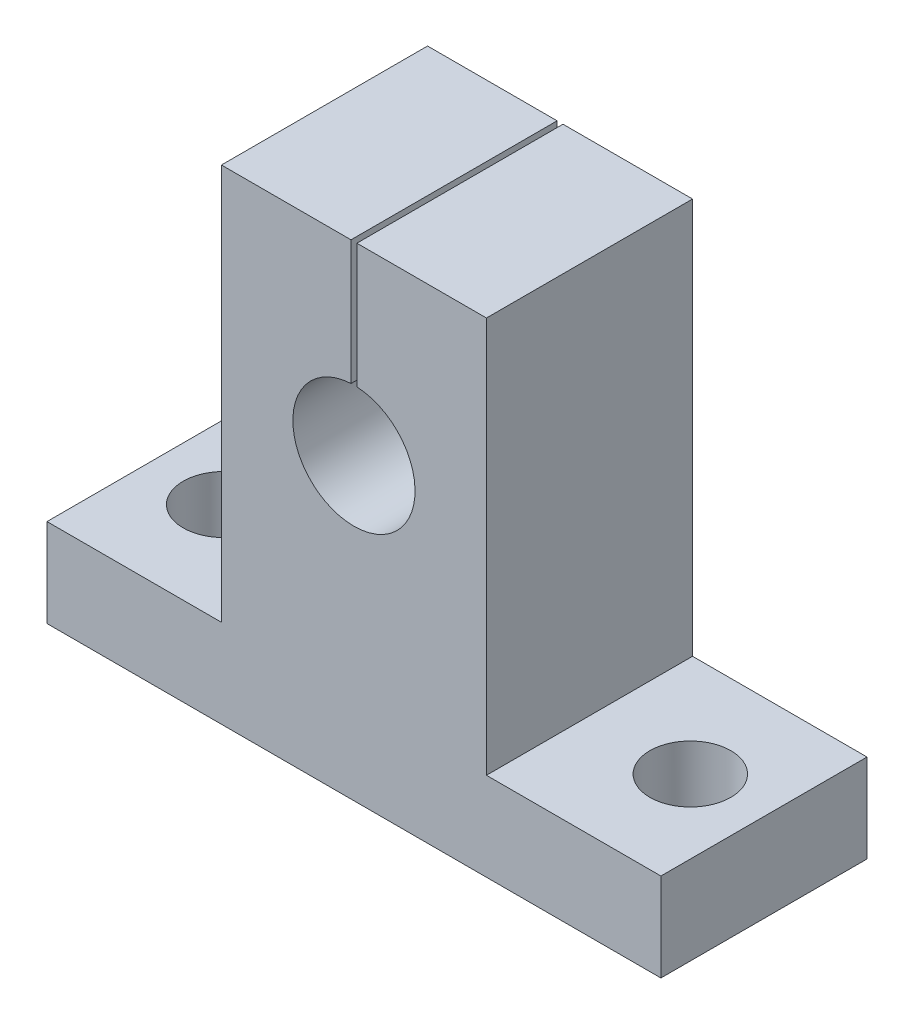
ISO-10303-21;
HEADER;
FILE_DESCRIPTION(('STEP AP214'),'2;1');
FILE_NAME('part.step','',(''),(''),'','','');
FILE_SCHEMA(('AUTOMOTIVE_DESIGN { 1 0 10303 214 1 1 1 1 }'));
ENDSEC;
DATA;
#1=APPLICATION_CONTEXT('core data for automotive mechanical design processes');
#2=APPLICATION_PROTOCOL_DEFINITION('international standard','automotive_design',2000,#1);
#3=PRODUCT_CONTEXT('',#1,'mechanical');
#4=PRODUCT('Part','Part','',(#3));
#5=PRODUCT_RELATED_PRODUCT_CATEGORY('part','',(#4));
#6=PRODUCT_DEFINITION_FORMATION('','',#4);
#7=PRODUCT_DEFINITION_CONTEXT('part definition',#1,'design');
#8=PRODUCT_DEFINITION('design','',#6,#7);
#9=PRODUCT_DEFINITION_SHAPE('','',#8);
#10=(LENGTH_UNIT() NAMED_UNIT(*) SI_UNIT(.MILLI.,.METRE.));
#11=(NAMED_UNIT(*) PLANE_ANGLE_UNIT() SI_UNIT($,.RADIAN.));
#12=(NAMED_UNIT(*) SI_UNIT($,.STERADIAN.) SOLID_ANGLE_UNIT());
#13=UNCERTAINTY_MEASURE_WITH_UNIT(LENGTH_MEASURE(1.E-05),#10,'distance_accuracy_value','');
#14=(GEOMETRIC_REPRESENTATION_CONTEXT(3) GLOBAL_UNCERTAINTY_ASSIGNED_CONTEXT((#13)) GLOBAL_UNIT_ASSIGNED_CONTEXT((#10,
#11,#12)) REPRESENTATION_CONTEXT('',''));
#15=CARTESIAN_POINT('',(0.,0.,0.));
#16=DIRECTION('',(0.,0.,1.));
#17=DIRECTION('',(1.,0.,0.));
#18=AXIS2_PLACEMENT_3D('',#15,#16,#17);
#19=CARTESIAN_POINT('',(0.,20.3,14.));
#20=DIRECTION('',(0.,0.,-1.));
#21=DIRECTION('',(-1.,0.,0.));
#22=AXIS2_PLACEMENT_3D('',#19,#20,#21);
#23=CYLINDRICAL_SURFACE('',#22,4.15);
#24=CARTESIAN_POINT('',(0.,20.3,0.));
#25=DIRECTION('',(0.,0.,1.));
#26=DIRECTION('',(1.,0.,0.));
#27=AXIS2_PLACEMENT_3D('',#24,#25,#26);
#28=CIRCLE('',#27,4.15);
#29=CARTESIAN_POINT('',(-0.200000000000001,24.4451779213925,0.));
#30=VERTEX_POINT('',#29);
#31=CARTESIAN_POINT('',(0.199999999999999,24.4451779213925,0.));
#32=VERTEX_POINT('',#31);
#33=EDGE_CURVE('E153',#30,#32,#28,.T.);
#34=ORIENTED_EDGE('',*,*,#33,.F.);
#35=DIRECTION('',(0.,0.,-1.));
#36=VECTOR('',#35,1.);
#37=CARTESIAN_POINT('',(-0.200000000000001,24.4451779213925,14.));
#38=LINE('',#37,#36);
#39=CARTESIAN_POINT('',(-0.200000000000001,24.4451779213925,14.));
#40=VERTEX_POINT('',#39);
#41=EDGE_CURVE('E11',#40,#30,#38,.T.);
#42=ORIENTED_EDGE('',*,*,#41,.F.);
#43=CARTESIAN_POINT('',(0.,20.3,14.));
#44=DIRECTION('',(0.,0.,1.));
#45=DIRECTION('',(1.,0.,0.));
#46=AXIS2_PLACEMENT_3D('',#43,#44,#45);
#47=CIRCLE('',#46,4.15);
#48=CARTESIAN_POINT('',(0.199999999999999,24.4451779213925,14.));
#49=VERTEX_POINT('',#48);
#50=EDGE_CURVE('E186',#40,#49,#47,.T.);
#51=ORIENTED_EDGE('',*,*,#50,.T.);
#52=DIRECTION('',(0.,0.,-1.));
#53=VECTOR('',#52,1.);
#54=CARTESIAN_POINT('',(0.199999999999999,24.4451779213925,14.));
#55=LINE('',#54,#53);
#56=EDGE_CURVE('E52',#49,#32,#55,.T.);
#57=ORIENTED_EDGE('',*,*,#56,.T.);
#58=EDGE_LOOP('',(#34,#42,#51,#57));
#59=FACE_BOUND('',#58,.T.);
#60=ADVANCED_FACE('F35',(#59),#23,.F.);
#61=CARTESIAN_POINT('',(-0.199999999999982,0.,14.));
#62=DIRECTION('',(1.,0.,0.));
#63=DIRECTION('',(0.,1.,0.));
#64=AXIS2_PLACEMENT_3D('',#61,#62,#63);
#65=PLANE('',#64);
#66=DIRECTION('',(0.,-1.,0.));
#67=VECTOR('',#66,1.);
#68=CARTESIAN_POINT('',(-0.199999999999982,0.,0.));
#69=LINE('',#68,#67);
#70=CARTESIAN_POINT('',(-0.200000000000008,32.9,0.));
#71=VERTEX_POINT('',#70);
#72=EDGE_CURVE('E155',#71,#30,#69,.T.);
#73=ORIENTED_EDGE('',*,*,#72,.F.);
#74=DIRECTION('',(0.,0.,-1.));
#75=VECTOR('',#74,1.);
#76=CARTESIAN_POINT('',(-0.200000000000008,32.9,14.));
#77=LINE('',#76,#75);
#78=CARTESIAN_POINT('',(-0.200000000000008,32.9,14.));
#79=VERTEX_POINT('',#78);
#80=EDGE_CURVE('E44',#79,#71,#77,.T.);
#81=ORIENTED_EDGE('',*,*,#80,.F.);
#82=DIRECTION('',(0.,-1.,0.));
#83=VECTOR('',#82,1.);
#84=CARTESIAN_POINT('',(-0.199999999999982,0.,14.));
#85=LINE('',#84,#83);
#86=EDGE_CURVE('E224',#79,#40,#85,.T.);
#87=ORIENTED_EDGE('',*,*,#86,.T.);
#88=ORIENTED_EDGE('',*,*,#41,.T.);
#89=EDGE_LOOP('',(#73,#81,#87,#88));
#90=FACE_BOUND('',#89,.T.);
#91=ADVANCED_FACE('F212',(#90),#65,.T.);
#92=CARTESIAN_POINT('',(0.,32.9,14.));
#93=DIRECTION('',(0.,1.,0.));
#94=DIRECTION('',(0.,0.,1.));
#95=AXIS2_PLACEMENT_3D('',#92,#93,#94);
#96=PLANE('',#95);
#97=DIRECTION('',(1.,0.,0.));
#98=VECTOR('',#97,1.);
#99=CARTESIAN_POINT('',(0.,32.9,0.));
#100=LINE('',#99,#98);
#101=CARTESIAN_POINT('',(-9.,32.9,0.));
#102=VERTEX_POINT('',#101);
#103=EDGE_CURVE('E159',#102,#71,#100,.T.);
#104=ORIENTED_EDGE('',*,*,#103,.F.);
#105=DIRECTION('',(0.,0.,-1.));
#106=VECTOR('',#105,1.);
#107=CARTESIAN_POINT('',(-9.,32.9,14.));
#108=LINE('',#107,#106);
#109=CARTESIAN_POINT('',(-9.,32.9,14.));
#110=VERTEX_POINT('',#109);
#111=EDGE_CURVE('E200',#110,#102,#108,.T.);
#112=ORIENTED_EDGE('',*,*,#111,.F.);
#113=DIRECTION('',(1.,0.,0.));
#114=VECTOR('',#113,1.);
#115=CARTESIAN_POINT('',(0.,32.9,14.));
#116=LINE('',#115,#114);
#117=EDGE_CURVE('E208',#110,#79,#116,.T.);
#118=ORIENTED_EDGE('',*,*,#117,.T.);
#119=ORIENTED_EDGE('',*,*,#80,.T.);
#120=EDGE_LOOP('',(#104,#112,#118,#119));
#121=FACE_BOUND('',#120,.T.);
#122=ADVANCED_FACE('F206',(#121),#96,.T.);
#123=CARTESIAN_POINT('',(-8.99999999999999,0.,14.));
#124=DIRECTION('',(-1.,0.,0.));
#125=DIRECTION('',(0.,-1.,0.));
#126=AXIS2_PLACEMENT_3D('',#123,#124,#125);
#127=PLANE('',#126);
#128=DIRECTION('',(0.,1.,0.));
#129=VECTOR('',#128,1.);
#130=CARTESIAN_POINT('',(-8.99999999999999,0.,0.));
#131=LINE('',#130,#129);
#132=CARTESIAN_POINT('',(-9.,6.,0.));
#133=VERTEX_POINT('',#132);
#134=EDGE_CURVE('E162',#133,#102,#131,.T.);
#135=ORIENTED_EDGE('',*,*,#134,.F.);
#136=DIRECTION('',(0.,0.,-1.));
#137=VECTOR('',#136,1.);
#138=CARTESIAN_POINT('',(-9.,6.,14.));
#139=LINE('',#138,#137);
#140=CARTESIAN_POINT('',(-9.,6.,14.));
#141=VERTEX_POINT('',#140);
#142=EDGE_CURVE('E198',#141,#133,#139,.T.);
#143=ORIENTED_EDGE('',*,*,#142,.F.);
#144=DIRECTION('',(0.,1.,0.));
#145=VECTOR('',#144,1.);
#146=CARTESIAN_POINT('',(-8.99999999999999,0.,14.));
#147=LINE('',#146,#145);
#148=EDGE_CURVE('E221',#141,#110,#147,.T.);
#149=ORIENTED_EDGE('',*,*,#148,.T.);
#150=ORIENTED_EDGE('',*,*,#111,.T.);
#151=EDGE_LOOP('',(#135,#143,#149,#150));
#152=FACE_BOUND('',#151,.T.);
#153=ADVANCED_FACE('F218',(#152),#127,.T.);
#154=CARTESIAN_POINT('',(0.,6.,14.));
#155=DIRECTION('',(0.,1.,0.));
#156=DIRECTION('',(0.,0.,1.));
#157=AXIS2_PLACEMENT_3D('',#154,#155,#156);
#158=PLANE('',#157);
#159=CARTESIAN_POINT('',(-15.85,6.,7.));
#160=DIRECTION('',(0.,1.,0.));
#161=DIRECTION('',(0.,0.,1.));
#162=AXIS2_PLACEMENT_3D('',#159,#160,#161);
#163=CIRCLE('',#162,2.75);
#164=CARTESIAN_POINT('',(-15.85,6.,9.75));
#165=VERTEX_POINT('',#164);
#166=EDGE_CURVE('E156',#165,#165,#163,.T.);
#167=ORIENTED_EDGE('',*,*,#166,.F.);
#168=EDGE_LOOP('',(#167));
#169=FACE_BOUND('',#168,.T.);
#170=DIRECTION('',(1.,0.,0.));
#171=VECTOR('',#170,1.);
#172=CARTESIAN_POINT('',(0.,6.,0.));
#173=LINE('',#172,#171);
#174=CARTESIAN_POINT('',(-20.85,6.,0.));
#175=VERTEX_POINT('',#174);
#176=EDGE_CURVE('E165',#175,#133,#173,.T.);
#177=ORIENTED_EDGE('',*,*,#176,.F.);
#178=DIRECTION('',(0.,0.,-1.));
#179=VECTOR('',#178,1.);
#180=CARTESIAN_POINT('',(-20.85,6.,14.));
#181=LINE('',#180,#179);
#182=CARTESIAN_POINT('',(-20.85,6.,14.));
#183=VERTEX_POINT('',#182);
#184=EDGE_CURVE('E196',#183,#175,#181,.T.);
#185=ORIENTED_EDGE('',*,*,#184,.F.);
#186=DIRECTION('',(1.,0.,0.));
#187=VECTOR('',#186,1.);
#188=CARTESIAN_POINT('',(0.,6.,14.));
#189=LINE('',#188,#187);
#190=EDGE_CURVE('E226',#183,#141,#189,.T.);
#191=ORIENTED_EDGE('',*,*,#190,.T.);
#192=ORIENTED_EDGE('',*,*,#142,.T.);
#193=EDGE_LOOP('',(#177,#185,#191,#192));
#194=FACE_BOUND('',#193,.T.);
#195=ADVANCED_FACE('F264',(#169,#194),#158,.T.);
#196=CARTESIAN_POINT('',(-20.85,0.,14.));
#197=DIRECTION('',(-1.,0.,0.));
#198=DIRECTION('',(0.,0.,1.));
#199=AXIS2_PLACEMENT_3D('',#196,#197,#198);
#200=PLANE('',#199);
#201=DIRECTION('',(0.,1.,0.));
#202=VECTOR('',#201,1.);
#203=CARTESIAN_POINT('',(-20.85,0.,0.));
#204=LINE('',#203,#202);
#205=CARTESIAN_POINT('',(-20.85,0.,0.));
#206=VERTEX_POINT('',#205);
#207=EDGE_CURVE('E168',#206,#175,#204,.T.);
#208=ORIENTED_EDGE('',*,*,#207,.F.);
#209=DIRECTION('',(0.,0.,-1.));
#210=VECTOR('',#209,1.);
#211=CARTESIAN_POINT('',(-20.85,0.,14.));
#212=LINE('',#211,#210);
#213=CARTESIAN_POINT('',(-20.85,0.,14.));
#214=VERTEX_POINT('',#213);
#215=EDGE_CURVE('E194',#214,#206,#212,.T.);
#216=ORIENTED_EDGE('',*,*,#215,.F.);
#217=DIRECTION('',(0.,1.,0.));
#218=VECTOR('',#217,1.);
#219=CARTESIAN_POINT('',(-20.85,0.,14.));
#220=LINE('',#219,#218);
#221=EDGE_CURVE('E232',#214,#183,#220,.T.);
#222=ORIENTED_EDGE('',*,*,#221,.T.);
#223=ORIENTED_EDGE('',*,*,#184,.T.);
#224=EDGE_LOOP('',(#208,#216,#222,#223));
#225=FACE_BOUND('',#224,.T.);
#226=ADVANCED_FACE('F267',(#225),#200,.T.);
#227=CARTESIAN_POINT('',(0.,0.,14.));
#228=DIRECTION('',(0.,1.,0.));
#229=DIRECTION('',(-1.,0.,0.));
#230=AXIS2_PLACEMENT_3D('',#227,#228,#229);
#231=PLANE('',#230);
#232=CARTESIAN_POINT('',(-15.85,0.,7.));
#233=DIRECTION('',(0.,-1.,0.));
#234=DIRECTION('',(1.,0.,0.));
#235=AXIS2_PLACEMENT_3D('',#232,#233,#234);
#236=CIRCLE('',#235,2.75);
#237=CARTESIAN_POINT('',(-13.1,0.,7.));
#238=VERTEX_POINT('',#237);
#239=EDGE_CURVE('E358',#238,#238,#236,.T.);
#240=ORIENTED_EDGE('',*,*,#239,.F.);
#241=EDGE_LOOP('',(#240));
#242=FACE_BOUND('',#241,.T.);
#243=CARTESIAN_POINT('',(15.85,0.,7.));
#244=DIRECTION('',(0.,-1.,0.));
#245=DIRECTION('',(1.,0.,0.));
#246=AXIS2_PLACEMENT_3D('',#243,#244,#245);
#247=CIRCLE('',#246,2.75);
#248=CARTESIAN_POINT('',(18.6,0.,7.));
#249=VERTEX_POINT('',#248);
#250=EDGE_CURVE('E359',#249,#249,#247,.T.);
#251=ORIENTED_EDGE('',*,*,#250,.F.);
#252=EDGE_LOOP('',(#251));
#253=FACE_BOUND('',#252,.T.);
#254=DIRECTION('',(1.,0.,0.));
#255=VECTOR('',#254,1.);
#256=CARTESIAN_POINT('',(0.,0.,0.));
#257=LINE('',#256,#255);
#258=CARTESIAN_POINT('',(20.85,0.,0.));
#259=VERTEX_POINT('',#258);
#260=EDGE_CURVE('E171',#206,#259,#257,.T.);
#261=ORIENTED_EDGE('',*,*,#260,.T.);
#262=DIRECTION('',(0.,0.,-1.));
#263=VECTOR('',#262,1.);
#264=CARTESIAN_POINT('',(20.85,0.,14.));
#265=LINE('',#264,#263);
#266=CARTESIAN_POINT('',(20.85,0.,14.));
#267=VERTEX_POINT('',#266);
#268=EDGE_CURVE('E192',#267,#259,#265,.T.);
#269=ORIENTED_EDGE('',*,*,#268,.F.);
#270=DIRECTION('',(1.,0.,0.));
#271=VECTOR('',#270,1.);
#272=CARTESIAN_POINT('',(0.,0.,14.));
#273=LINE('',#272,#271);
#274=EDGE_CURVE('E235',#214,#267,#273,.T.);
#275=ORIENTED_EDGE('',*,*,#274,.F.);
#276=ORIENTED_EDGE('',*,*,#215,.T.);
#277=EDGE_LOOP('',(#261,#269,#275,#276));
#278=FACE_BOUND('',#277,.T.);
#279=ADVANCED_FACE('F271',(#242,#253,#278),#231,.F.);
#280=CARTESIAN_POINT('',(20.85,0.,14.));
#281=DIRECTION('',(1.,0.,0.));
#282=DIRECTION('',(0.,0.,-1.));
#283=AXIS2_PLACEMENT_3D('',#280,#281,#282);
#284=PLANE('',#283);
#285=DIRECTION('',(0.,-1.,0.));
#286=VECTOR('',#285,1.);
#287=CARTESIAN_POINT('',(20.85,0.,0.));
#288=LINE('',#287,#286);
#289=CARTESIAN_POINT('',(20.85,6.00000000000001,0.));
#290=VERTEX_POINT('',#289);
#291=EDGE_CURVE('E174',#290,#259,#288,.T.);
#292=ORIENTED_EDGE('',*,*,#291,.F.);
#293=DIRECTION('',(0.,0.,-1.));
#294=VECTOR('',#293,1.);
#295=CARTESIAN_POINT('',(20.85,6.00000000000001,14.));
#296=LINE('',#295,#294);
#297=CARTESIAN_POINT('',(20.85,6.00000000000001,14.));
#298=VERTEX_POINT('',#297);
#299=EDGE_CURVE('E190',#298,#290,#296,.T.);
#300=ORIENTED_EDGE('',*,*,#299,.F.);
#301=DIRECTION('',(0.,-1.,0.));
#302=VECTOR('',#301,1.);
#303=CARTESIAN_POINT('',(20.85,0.,14.));
#304=LINE('',#303,#302);
#305=EDGE_CURVE('E237',#298,#267,#304,.T.);
#306=ORIENTED_EDGE('',*,*,#305,.T.);
#307=ORIENTED_EDGE('',*,*,#268,.T.);
#308=EDGE_LOOP('',(#292,#300,#306,#307));
#309=FACE_BOUND('',#308,.T.);
#310=ADVANCED_FACE('F275',(#309),#284,.T.);
#311=CARTESIAN_POINT('',(0.,6.,14.));
#312=DIRECTION('',(0.,1.,0.));
#313=DIRECTION('',(-1.,0.,0.));
#314=AXIS2_PLACEMENT_3D('',#311,#312,#313);
#315=PLANE('',#314);
#316=CARTESIAN_POINT('',(15.85,6.00000000000001,7.));
#317=DIRECTION('',(0.,1.,0.));
#318=DIRECTION('',(-1.,0.,0.));
#319=AXIS2_PLACEMENT_3D('',#316,#317,#318);
#320=CIRCLE('',#319,2.75);
#321=CARTESIAN_POINT('',(13.1,6.,7.));
#322=VERTEX_POINT('',#321);
#323=EDGE_CURVE('E38',#322,#322,#320,.T.);
#324=ORIENTED_EDGE('',*,*,#323,.F.);
#325=EDGE_LOOP('',(#324));
#326=FACE_BOUND('',#325,.T.);
#327=DIRECTION('',(1.,0.,0.));
#328=VECTOR('',#327,1.);
#329=CARTESIAN_POINT('',(0.,6.,0.));
#330=LINE('',#329,#328);
#331=CARTESIAN_POINT('',(8.99999999999999,6.,0.));
#332=VERTEX_POINT('',#331);
#333=EDGE_CURVE('E177',#332,#290,#330,.T.);
#334=ORIENTED_EDGE('',*,*,#333,.F.);
#335=DIRECTION('',(0.,0.,-1.));
#336=VECTOR('',#335,1.);
#337=CARTESIAN_POINT('',(8.99999999999999,6.,14.));
#338=LINE('',#337,#336);
#339=CARTESIAN_POINT('',(8.99999999999999,6.,14.));
#340=VERTEX_POINT('',#339);
#341=EDGE_CURVE('E135',#340,#332,#338,.T.);
#342=ORIENTED_EDGE('',*,*,#341,.F.);
#343=DIRECTION('',(1.,0.,0.));
#344=VECTOR('',#343,1.);
#345=CARTESIAN_POINT('',(0.,6.,14.));
#346=LINE('',#345,#344);
#347=EDGE_CURVE('E145',#340,#298,#346,.T.);
#348=ORIENTED_EDGE('',*,*,#347,.T.);
#349=ORIENTED_EDGE('',*,*,#299,.T.);
#350=EDGE_LOOP('',(#334,#342,#348,#349));
#351=FACE_BOUND('',#350,.T.);
#352=ADVANCED_FACE('F241',(#326,#351),#315,.T.);
#353=CARTESIAN_POINT('',(8.99999999999999,0.,14.));
#354=DIRECTION('',(1.,0.,0.));
#355=DIRECTION('',(0.,0.,-1.));
#356=AXIS2_PLACEMENT_3D('',#353,#354,#355);
#357=PLANE('',#356);
#358=DIRECTION('',(0.,-1.,0.));
#359=VECTOR('',#358,1.);
#360=CARTESIAN_POINT('',(8.99999999999999,0.,0.));
#361=LINE('',#360,#359);
#362=CARTESIAN_POINT('',(8.99999999999999,32.9,0.));
#363=VERTEX_POINT('',#362);
#364=EDGE_CURVE('E131',#363,#332,#361,.T.);
#365=ORIENTED_EDGE('',*,*,#364,.F.);
#366=DIRECTION('',(0.,0.,-1.));
#367=VECTOR('',#366,1.);
#368=CARTESIAN_POINT('',(8.99999999999999,32.9,14.));
#369=LINE('',#368,#367);
#370=CARTESIAN_POINT('',(8.99999999999999,32.9,14.));
#371=VERTEX_POINT('',#370);
#372=EDGE_CURVE('E126',#371,#363,#369,.T.);
#373=ORIENTED_EDGE('',*,*,#372,.F.);
#374=DIRECTION('',(0.,-1.,0.));
#375=VECTOR('',#374,1.);
#376=CARTESIAN_POINT('',(8.99999999999999,0.,14.));
#377=LINE('',#376,#375);
#378=EDGE_CURVE('E129',#371,#340,#377,.T.);
#379=ORIENTED_EDGE('',*,*,#378,.T.);
#380=ORIENTED_EDGE('',*,*,#341,.T.);
#381=EDGE_LOOP('',(#365,#373,#379,#380));
#382=FACE_BOUND('',#381,.T.);
#383=ADVANCED_FACE('F128',(#382),#357,.T.);
#384=CARTESIAN_POINT('',(0.,32.9,14.));
#385=DIRECTION('',(0.,1.,0.));
#386=DIRECTION('',(0.,0.,1.));
#387=AXIS2_PLACEMENT_3D('',#384,#385,#386);
#388=PLANE('',#387);
#389=DIRECTION('',(1.,0.,0.));
#390=VECTOR('',#389,1.);
#391=CARTESIAN_POINT('',(0.,32.9,0.));
#392=LINE('',#391,#390);
#393=CARTESIAN_POINT('',(0.199999999999996,32.9,0.));
#394=VERTEX_POINT('',#393);
#395=EDGE_CURVE('E181',#394,#363,#392,.T.);
#396=ORIENTED_EDGE('',*,*,#395,.F.);
#397=DIRECTION('',(0.,0.,-1.));
#398=VECTOR('',#397,1.);
#399=CARTESIAN_POINT('',(0.199999999999996,32.9,14.));
#400=LINE('',#399,#398);
#401=CARTESIAN_POINT('',(0.199999999999996,32.9,14.));
#402=VERTEX_POINT('',#401);
#403=EDGE_CURVE('E89',#402,#394,#400,.T.);
#404=ORIENTED_EDGE('',*,*,#403,.F.);
#405=DIRECTION('',(1.,0.,0.));
#406=VECTOR('',#405,1.);
#407=CARTESIAN_POINT('',(0.,32.9,14.));
#408=LINE('',#407,#406);
#409=EDGE_CURVE('E142',#402,#371,#408,.T.);
#410=ORIENTED_EDGE('',*,*,#409,.T.);
#411=ORIENTED_EDGE('',*,*,#372,.T.);
#412=EDGE_LOOP('',(#396,#404,#410,#411));
#413=FACE_BOUND('',#412,.T.);
#414=ADVANCED_FACE('F147',(#413),#388,.T.);
#415=CARTESIAN_POINT('',(0.200000000000007,0.,14.));
#416=DIRECTION('',(-1.,0.,0.));
#417=DIRECTION('',(0.,-1.,0.));
#418=AXIS2_PLACEMENT_3D('',#415,#416,#417);
#419=PLANE('',#418);
#420=DIRECTION('',(0.,1.,0.));
#421=VECTOR('',#420,1.);
#422=CARTESIAN_POINT('',(0.200000000000007,0.,0.));
#423=LINE('',#422,#421);
#424=EDGE_CURVE('E183',#32,#394,#423,.T.);
#425=ORIENTED_EDGE('',*,*,#424,.F.);
#426=ORIENTED_EDGE('',*,*,#56,.F.);
#427=DIRECTION('',(0.,1.,0.));
#428=VECTOR('',#427,1.);
#429=CARTESIAN_POINT('',(0.200000000000007,0.,14.));
#430=LINE('',#429,#428);
#431=EDGE_CURVE('E148',#49,#402,#430,.T.);
#432=ORIENTED_EDGE('',*,*,#431,.T.);
#433=ORIENTED_EDGE('',*,*,#403,.T.);
#434=EDGE_LOOP('',(#425,#426,#432,#433));
#435=FACE_BOUND('',#434,.T.);
#436=ADVANCED_FACE('F243',(#435),#419,.T.);
#437=CARTESIAN_POINT('',(0.,0.,14.));
#438=DIRECTION('',(0.,0.,1.));
#439=DIRECTION('',(1.,0.,0.));
#440=AXIS2_PLACEMENT_3D('',#437,#438,#439);
#441=PLANE('',#440);
#442=ORIENTED_EDGE('',*,*,#50,.F.);
#443=ORIENTED_EDGE('',*,*,#86,.F.);
#444=ORIENTED_EDGE('',*,*,#117,.F.);
#445=ORIENTED_EDGE('',*,*,#148,.F.);
#446=ORIENTED_EDGE('',*,*,#190,.F.);
#447=ORIENTED_EDGE('',*,*,#221,.F.);
#448=ORIENTED_EDGE('',*,*,#274,.T.);
#449=ORIENTED_EDGE('',*,*,#305,.F.);
#450=ORIENTED_EDGE('',*,*,#347,.F.);
#451=ORIENTED_EDGE('',*,*,#378,.F.);
#452=ORIENTED_EDGE('',*,*,#409,.F.);
#453=ORIENTED_EDGE('',*,*,#431,.F.);
#454=EDGE_LOOP('',(#442,#443,#444,#445,#446,#447,#448,#449,#450,#451,#452,#453));
#455=FACE_BOUND('',#454,.T.);
#456=ADVANCED_FACE('F140',(#455),#441,.T.);
#457=CARTESIAN_POINT('',(0.,0.,0.));
#458=DIRECTION('',(0.,0.,1.));
#459=DIRECTION('',(1.,0.,0.));
#460=AXIS2_PLACEMENT_3D('',#457,#458,#459);
#461=PLANE('',#460);
#462=ORIENTED_EDGE('',*,*,#33,.T.);
#463=ORIENTED_EDGE('',*,*,#424,.T.);
#464=ORIENTED_EDGE('',*,*,#395,.T.);
#465=ORIENTED_EDGE('',*,*,#364,.T.);
#466=ORIENTED_EDGE('',*,*,#333,.T.);
#467=ORIENTED_EDGE('',*,*,#291,.T.);
#468=ORIENTED_EDGE('',*,*,#260,.F.);
#469=ORIENTED_EDGE('',*,*,#207,.T.);
#470=ORIENTED_EDGE('',*,*,#176,.T.);
#471=ORIENTED_EDGE('',*,*,#134,.T.);
#472=ORIENTED_EDGE('',*,*,#103,.T.);
#473=ORIENTED_EDGE('',*,*,#72,.T.);
#474=EDGE_LOOP('',(#462,#463,#464,#465,#466,#467,#468,#469,#470,#471,#472,#473));
#475=FACE_BOUND('',#474,.T.);
#476=ADVANCED_FACE('F214',(#475),#461,.F.);
#477=CARTESIAN_POINT('',(15.85,32.9,7.));
#478=DIRECTION('',(0.,-1.,0.));
#479=DIRECTION('',(1.,0.,0.));
#480=AXIS2_PLACEMENT_3D('',#477,#478,#479);
#481=CYLINDRICAL_SURFACE('',#480,2.75);
#482=ORIENTED_EDGE('',*,*,#323,.T.);
#483=EDGE_LOOP('',(#482));
#484=FACE_BOUND('',#483,.T.);
#485=ORIENTED_EDGE('',*,*,#250,.T.);
#486=EDGE_LOOP('',(#485));
#487=FACE_BOUND('',#486,.T.);
#488=ADVANCED_FACE('F312',(#484,#487),#481,.F.);
#489=CARTESIAN_POINT('',(-15.85,32.9,7.));
#490=DIRECTION('',(0.,-1.,0.));
#491=DIRECTION('',(1.,0.,0.));
#492=AXIS2_PLACEMENT_3D('',#489,#490,#491);
#493=CYLINDRICAL_SURFACE('',#492,2.75);
#494=ORIENTED_EDGE('',*,*,#166,.T.);
#495=EDGE_LOOP('',(#494));
#496=FACE_BOUND('',#495,.T.);
#497=ORIENTED_EDGE('',*,*,#239,.T.);
#498=EDGE_LOOP('',(#497));
#499=FACE_BOUND('',#498,.T.);
#500=ADVANCED_FACE('F339',(#496,#499),#493,.F.);
#501=CLOSED_SHELL('',(#60,#91,#122,#153,#195,#226,#279,#310,#352,#383,#414,#436,#456,#476,#488,#500));
#502=MANIFOLD_SOLID_BREP('B2',#501);
#503=ADVANCED_BREP_SHAPE_REPRESENTATION('',(#18,#502),#14);
#504=SHAPE_DEFINITION_REPRESENTATION(#9,#503);
ENDSEC;
END-ISO-10303-21;
